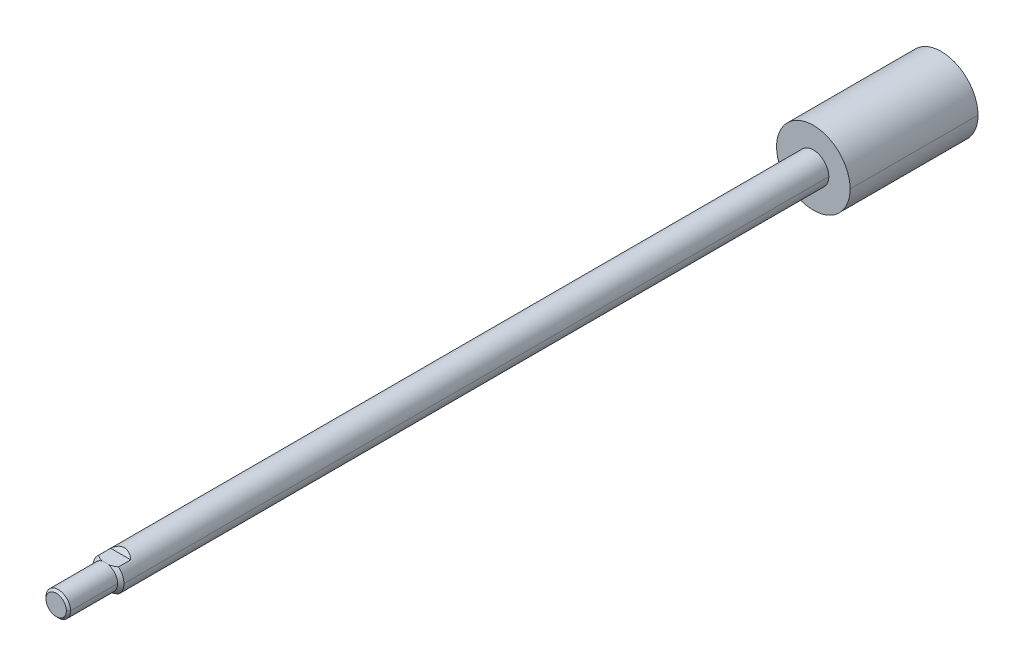
ISO-10303-21;
HEADER;
FILE_DESCRIPTION(('STEP AP214'),'2;1');
FILE_NAME('part.step','',(''),(''),'','','');
FILE_SCHEMA(('AUTOMOTIVE_DESIGN { 1 0 10303 214 1 1 1 1 }'));
ENDSEC;
DATA;
#1=APPLICATION_CONTEXT('core data for automotive mechanical design processes');
#2=APPLICATION_PROTOCOL_DEFINITION('international standard','automotive_design',2000,#1);
#3=PRODUCT_CONTEXT('',#1,'mechanical');
#4=PRODUCT('Part','Part','',(#3));
#5=PRODUCT_RELATED_PRODUCT_CATEGORY('part','',(#4));
#6=PRODUCT_DEFINITION_FORMATION('','',#4);
#7=PRODUCT_DEFINITION_CONTEXT('part definition',#1,'design');
#8=PRODUCT_DEFINITION('design','',#6,#7);
#9=PRODUCT_DEFINITION_SHAPE('','',#8);
#10=(LENGTH_UNIT() NAMED_UNIT(*) SI_UNIT(.MILLI.,.METRE.));
#11=(NAMED_UNIT(*) PLANE_ANGLE_UNIT() SI_UNIT($,.RADIAN.));
#12=(NAMED_UNIT(*) SI_UNIT($,.STERADIAN.) SOLID_ANGLE_UNIT());
#13=UNCERTAINTY_MEASURE_WITH_UNIT(LENGTH_MEASURE(1.E-05),#10,'distance_accuracy_value','');
#14=(GEOMETRIC_REPRESENTATION_CONTEXT(3) GLOBAL_UNCERTAINTY_ASSIGNED_CONTEXT((#13)) GLOBAL_UNIT_ASSIGNED_CONTEXT((#10,
#11,#12)) REPRESENTATION_CONTEXT('',''));
#15=CARTESIAN_POINT('',(0.,0.,0.));
#16=DIRECTION('',(0.,0.,1.));
#17=DIRECTION('',(1.,0.,0.));
#18=AXIS2_PLACEMENT_3D('',#15,#16,#17);
#19=CARTESIAN_POINT('',(8.001,3.048,0.));
#20=DIRECTION('',(0.,1.,0.));
#21=DIRECTION('',(0.,0.,1.));
#22=AXIS2_PLACEMENT_3D('',#19,#20,#21);
#23=PLANE('',#22);
#24=CARTESIAN_POINT('',(0.888999999999997,3.048,0.));
#25=CARTESIAN_POINT('',(1.19636934694901,3.048,-0.0860634171457216));
#26=CARTESIAN_POINT('',(1.48745867684962,3.048,-0.207801742749073));
#27=CARTESIAN_POINT('',(2.05151290563483,3.048,-0.490995024191551));
#28=CARTESIAN_POINT('',(2.32537290457223,3.048,-0.653404332540558));
#29=CARTESIAN_POINT('',(2.59108013191411,3.048,-0.825500000000002));
#30=B_SPLINE_CURVE_WITH_KNOTS('',3,(#24,#25,#26,#27,#28,#29),.UNSPECIFIED.,.F.,.F.,(4,2,4),
(0.011157264649979,0.0121009403352805,0.0130446160205819),.UNSPECIFIED.);
#31=CARTESIAN_POINT('',(0.888999999999997,3.048,0.));
#32=VERTEX_POINT('',#31);
#33=CARTESIAN_POINT('',(2.59108013191411,3.048,-0.825500000000008));
#34=VERTEX_POINT('',#33);
#35=EDGE_CURVE('E11',#32,#34,#30,.T.);
#36=ORIENTED_EDGE('',*,*,#35,.T.);
#37=DIRECTION('',(0.,0.,-1.));
#38=VECTOR('',#37,1.);
#39=CARTESIAN_POINT('',(2.59108013191411,3.048,-216.18575));
#40=LINE('',#39,#38);
#41=CARTESIAN_POINT('',(2.59108013191411,3.048,-3.9878));
#42=VERTEX_POINT('',#41);
#43=EDGE_CURVE('E25',#34,#42,#40,.T.);
#44=ORIENTED_EDGE('',*,*,#43,.T.);
#45=DIRECTION('',(-1.,0.,0.));
#46=VECTOR('',#45,1.);
#47=CARTESIAN_POINT('',(8.001,3.048,-3.9878));
#48=LINE('',#47,#46);
#49=CARTESIAN_POINT('',(-2.59108013191411,3.048,-3.9878));
#50=VERTEX_POINT('',#49);
#51=EDGE_CURVE('E379',#42,#50,#48,.T.);
#52=ORIENTED_EDGE('',*,*,#51,.T.);
#53=DIRECTION('',(0.,0.,-1.));
#54=VECTOR('',#53,1.);
#55=CARTESIAN_POINT('',(-2.59108013191411,3.048,-216.18575));
#56=LINE('',#55,#54);
#57=CARTESIAN_POINT('',(-2.59108013191411,3.048,-0.825500000000008));
#58=VERTEX_POINT('',#57);
#59=EDGE_CURVE('E376',#58,#50,#56,.T.);
#60=ORIENTED_EDGE('',*,*,#59,.F.);
#61=CARTESIAN_POINT('',(-2.59108013191411,3.048,-0.825500000000008));
#62=CARTESIAN_POINT('',(-2.32749145900717,3.048,-0.654776497096182));
#63=CARTESIAN_POINT('',(-2.05688176809806,3.048,-0.493920895952821));
#64=CARTESIAN_POINT('',(-1.48969976149748,3.048,-0.208699648643595));
#65=CARTESIAN_POINT('',(-1.19383279160222,3.048,-0.0853531816486107));
#66=CARTESIAN_POINT('',(-0.889000000000003,3.048,0.));
#67=B_SPLINE_CURVE_WITH_KNOTS('',3,(#61,#62,#63,#64,#65,#66),.UNSPECIFIED.,.F.,.F.,(4,2,4),
(0.00747818459539019,0.00842297104346002,0.00936775749152986),.UNSPECIFIED.);
#68=CARTESIAN_POINT('',(-0.888999999999997,3.048,0.));
#69=VERTEX_POINT('',#68);
#70=EDGE_CURVE('E192',#58,#69,#67,.T.);
#71=ORIENTED_EDGE('',*,*,#70,.T.);
#72=DIRECTION('',(-1.,0.,0.));
#73=VECTOR('',#72,1.);
#74=CARTESIAN_POINT('',(8.001,3.048,0.));
#75=LINE('',#74,#73);
#76=EDGE_CURVE('E360',#32,#69,#75,.T.);
#77=ORIENTED_EDGE('',*,*,#76,.F.);
#78=EDGE_LOOP('',(#36,#44,#52,#60,#71,#77));
#79=FACE_BOUND('',#78,.T.);
#80=ADVANCED_FACE('F17',(#79),#23,.T.);
#81=CARTESIAN_POINT('',(8.001,6.096,0.));
#82=DIRECTION('',(0.,0.,-1.));
#83=DIRECTION('',(-1.,0.,0.));
#84=AXIS2_PLACEMENT_3D('',#81,#82,#83);
#85=PLANE('',#84);
#86=ORIENTED_EDGE('',*,*,#76,.T.);
#87=CARTESIAN_POINT('',(0.,0.,0.));
#88=DIRECTION('',(0.,0.,-1.));
#89=DIRECTION('',(-1.,0.,0.));
#90=AXIS2_PLACEMENT_3D('',#87,#88,#89);
#91=CIRCLE('',#90,3.175);
#92=EDGE_CURVE('E355',#69,#32,#91,.T.);
#93=ORIENTED_EDGE('',*,*,#92,.T.);
#94=EDGE_LOOP('',(#86,#93));
#95=FACE_BOUND('',#94,.T.);
#96=ADVANCED_FACE('F409',(#95),#85,.T.);
#97=CARTESIAN_POINT('',(0.,0.,-216.18575));
#98=DIRECTION('',(0.,0.,1.));
#99=DIRECTION('',(0.,-1.,0.));
#100=AXIS2_PLACEMENT_3D('',#97,#98,#99);
#101=CYLINDRICAL_SURFACE('',#100,3.175);
#102=CARTESIAN_POINT('',(0.,0.,0.));
#103=DIRECTION('',(0.,0.,-1.));
#104=DIRECTION('',(-1.,0.,0.));
#105=AXIS2_PLACEMENT_3D('',#102,#103,#104);
#106=CIRCLE('',#105,3.175);
#107=CARTESIAN_POINT('',(3.175,0.,0.));
#108=VERTEX_POINT('',#107);
#109=EDGE_CURVE('E350',#32,#108,#106,.T.);
#110=ORIENTED_EDGE('',*,*,#109,.F.);
#111=ORIENTED_EDGE('',*,*,#92,.F.);
#112=CARTESIAN_POINT('',(0.,0.,0.));
#113=DIRECTION('',(0.,0.,-1.));
#114=DIRECTION('',(-1.,0.,0.));
#115=AXIS2_PLACEMENT_3D('',#112,#113,#114);
#116=CIRCLE('',#115,3.175);
#117=CARTESIAN_POINT('',(-3.175,0.,0.));
#118=VERTEX_POINT('',#117);
#119=EDGE_CURVE('E346',#118,#69,#116,.T.);
#120=ORIENTED_EDGE('',*,*,#119,.F.);
#121=DIRECTION('',(0.,0.,1.));
#122=VECTOR('',#121,1.);
#123=CARTESIAN_POINT('',(-3.175,0.,0.));
#124=LINE('',#123,#122);
#125=CARTESIAN_POINT('',(-3.175,0.,12.15898));
#126=VERTEX_POINT('',#125);
#127=EDGE_CURVE('E342',#118,#126,#124,.T.);
#128=ORIENTED_EDGE('',*,*,#127,.T.);
#129=CARTESIAN_POINT('',(0.,0.,12.15898));
#130=DIRECTION('',(0.,0.,-1.));
#131=DIRECTION('',(-1.,0.,0.));
#132=AXIS2_PLACEMENT_3D('',#129,#130,#131);
#133=CIRCLE('',#132,3.175);
#134=CARTESIAN_POINT('',(3.175,0.,12.15898));
#135=VERTEX_POINT('',#134);
#136=EDGE_CURVE('E338',#126,#135,#133,.T.);
#137=ORIENTED_EDGE('',*,*,#136,.T.);
#138=DIRECTION('',(0.,0.,1.));
#139=VECTOR('',#138,1.);
#140=CARTESIAN_POINT('',(3.175,0.,0.));
#141=LINE('',#140,#139);
#142=EDGE_CURVE('E333',#108,#135,#141,.T.);
#143=ORIENTED_EDGE('',*,*,#142,.F.);
#144=EDGE_LOOP('',(#110,#111,#120,#128,#137,#143));
#145=FACE_BOUND('',#144,.T.);
#146=ADVANCED_FACE('F413',(#145),#101,.T.);
#147=CARTESIAN_POINT('',(0.,0.,-216.18575));
#148=DIRECTION('',(0.,0.,1.));
#149=DIRECTION('',(0.,1.,0.));
#150=AXIS2_PLACEMENT_3D('',#147,#148,#149);
#151=CYLINDRICAL_SURFACE('',#150,3.175);
#152=CARTESIAN_POINT('',(0.,0.,12.15898));
#153=DIRECTION('',(0.,0.,-1.));
#154=DIRECTION('',(-1.,0.,0.));
#155=AXIS2_PLACEMENT_3D('',#152,#153,#154);
#156=CIRCLE('',#155,3.175);
#157=EDGE_CURVE('E116',#135,#126,#156,.T.);
#158=ORIENTED_EDGE('',*,*,#157,.T.);
#159=ORIENTED_EDGE('',*,*,#127,.F.);
#160=CARTESIAN_POINT('',(0.,0.,0.));
#161=DIRECTION('',(0.,0.,-1.));
#162=DIRECTION('',(-1.,0.,0.));
#163=AXIS2_PLACEMENT_3D('',#160,#161,#162);
#164=CIRCLE('',#163,3.175);
#165=CARTESIAN_POINT('',(-0.889,-3.048,0.));
#166=VERTEX_POINT('',#165);
#167=EDGE_CURVE('E326',#166,#118,#164,.T.);
#168=ORIENTED_EDGE('',*,*,#167,.F.);
#169=CARTESIAN_POINT('',(0.,0.,0.));
#170=DIRECTION('',(0.,0.,-1.));
#171=DIRECTION('',(-1.,0.,0.));
#172=AXIS2_PLACEMENT_3D('',#169,#170,#171);
#173=CIRCLE('',#172,3.175);
#174=CARTESIAN_POINT('',(0.889,-3.048,0.));
#175=VERTEX_POINT('',#174);
#176=EDGE_CURVE('E321',#175,#166,#173,.T.);
#177=ORIENTED_EDGE('',*,*,#176,.F.);
#178=CARTESIAN_POINT('',(0.,0.,0.));
#179=DIRECTION('',(0.,0.,-1.));
#180=DIRECTION('',(-1.,0.,0.));
#181=AXIS2_PLACEMENT_3D('',#178,#179,#180);
#182=CIRCLE('',#181,3.175);
#183=EDGE_CURVE('E319',#108,#175,#182,.T.);
#184=ORIENTED_EDGE('',*,*,#183,.F.);
#185=ORIENTED_EDGE('',*,*,#142,.T.);
#186=EDGE_LOOP('',(#158,#159,#168,#177,#184,#185));
#187=FACE_BOUND('',#186,.T.);
#188=ADVANCED_FACE('F298',(#187),#151,.T.);
#189=CARTESIAN_POINT('',(0.,0.,0.));
#190=DIRECTION('',(0.,0.,-1.));
#191=DIRECTION('',(-1.,0.,0.));
#192=AXIS2_PLACEMENT_3D('',#189,#190,#191);
#193=CONICAL_SURFACE('',#192,3.175,0.7853981634);
#194=CARTESIAN_POINT('',(2.59108013191411,-3.048,-0.825500000000007));
#195=CARTESIAN_POINT('',(2.32749145900718,-3.048,-0.654776497096182));
#196=CARTESIAN_POINT('',(2.05688176809806,-3.048,-0.493920895952823));
#197=CARTESIAN_POINT('',(1.48969976149748,-3.048,-0.208699648643596));
#198=CARTESIAN_POINT('',(1.19383279160222,-3.048,-0.0853531816486109));
#199=CARTESIAN_POINT('',(0.889000000000004,-3.048,0.));
#200=B_SPLINE_CURVE_WITH_KNOTS('',3,(#194,#195,#196,#197,#198,#199),.UNSPECIFIED.,.F.,.F.,(4,2,
4),(0.00747818459539019,0.00842297104346002,0.00936775749152985),.UNSPECIFIED.);
#201=CARTESIAN_POINT('',(2.59108013191411,-3.048,-0.825500000000008));
#202=VERTEX_POINT('',#201);
#203=EDGE_CURVE('E317',#202,#175,#200,.T.);
#204=ORIENTED_EDGE('',*,*,#203,.F.);
#205=CARTESIAN_POINT('',(0.,0.,-0.825500000000008));
#206=DIRECTION('',(0.,0.,-1.));
#207=DIRECTION('',(-1.,0.,0.));
#208=AXIS2_PLACEMENT_3D('',#205,#206,#207);
#209=CIRCLE('',#208,4.0005);
#210=CARTESIAN_POINT('',(4.0005,0.,-0.825500000000005));
#211=VERTEX_POINT('',#210);
#212=EDGE_CURVE('E425',#211,#202,#209,.T.);
#213=ORIENTED_EDGE('',*,*,#212,.F.);
#214=CARTESIAN_POINT('',(0.,0.,-0.825500000000008));
#215=DIRECTION('',(0.,0.,-1.));
#216=DIRECTION('',(-1.,0.,0.));
#217=AXIS2_PLACEMENT_3D('',#214,#215,#216);
#218=CIRCLE('',#217,4.0005);
#219=EDGE_CURVE('E279',#34,#211,#218,.T.);
#220=ORIENTED_EDGE('',*,*,#219,.F.);
#221=ORIENTED_EDGE('',*,*,#35,.F.);
#222=ORIENTED_EDGE('',*,*,#109,.T.);
#223=ORIENTED_EDGE('',*,*,#183,.T.);
#224=EDGE_LOOP('',(#204,#213,#220,#221,#222,#223));
#225=FACE_BOUND('',#224,.T.);
#226=ADVANCED_FACE('F287',(#225),#193,.T.);
#227=CARTESIAN_POINT('',(0.,0.,-216.18575));
#228=DIRECTION('',(0.,0.,1.));
#229=DIRECTION('',(0.,-1.,0.));
#230=AXIS2_PLACEMENT_3D('',#227,#228,#229);
#231=CYLINDRICAL_SURFACE('',#230,4.0005);
#232=CARTESIAN_POINT('',(0.,0.,-183.11495));
#233=DIRECTION('',(0.,0.,-1.));
#234=DIRECTION('',(-1.,0.,0.));
#235=AXIS2_PLACEMENT_3D('',#232,#233,#234);
#236=CIRCLE('',#235,4.0005);
#237=CARTESIAN_POINT('',(-4.0005,0.,-183.11495));
#238=VERTEX_POINT('',#237);
#239=CARTESIAN_POINT('',(4.0005,0.,-183.11495));
#240=VERTEX_POINT('',#239);
#241=EDGE_CURVE('E274',#238,#240,#236,.T.);
#242=ORIENTED_EDGE('',*,*,#241,.F.);
#243=DIRECTION('',(0.,0.,1.));
#244=VECTOR('',#243,1.);
#245=CARTESIAN_POINT('',(-4.0005,0.,-183.11495));
#246=LINE('',#245,#244);
#247=CARTESIAN_POINT('',(-4.0005,0.,-0.825500000000005));
#248=VERTEX_POINT('',#247);
#249=EDGE_CURVE('E270',#238,#248,#246,.T.);
#250=ORIENTED_EDGE('',*,*,#249,.T.);
#251=CARTESIAN_POINT('',(0.,0.,-0.825500000000008));
#252=DIRECTION('',(0.,0.,-1.));
#253=DIRECTION('',(-1.,0.,0.));
#254=AXIS2_PLACEMENT_3D('',#251,#252,#253);
#255=CIRCLE('',#254,4.0005);
#256=EDGE_CURVE('E265',#248,#58,#255,.T.);
#257=ORIENTED_EDGE('',*,*,#256,.T.);
#258=ORIENTED_EDGE('',*,*,#59,.T.);
#259=CARTESIAN_POINT('',(0.,0.,-0.939800000000018));
#260=DIRECTION('',(0.,0.707106781186548,0.707106781186547));
#261=DIRECTION('',(0.,0.707106781186547,-0.707106781186548));
#262=AXIS2_PLACEMENT_3D('',#259,#260,#261);
#263=ELLIPSE('',#262,5.65756135694,4.0005);
#264=EDGE_CURVE('E260',#42,#50,#263,.T.);
#265=ORIENTED_EDGE('',*,*,#264,.F.);
#266=ORIENTED_EDGE('',*,*,#43,.F.);
#267=ORIENTED_EDGE('',*,*,#219,.T.);
#268=DIRECTION('',(0.,0.,1.));
#269=VECTOR('',#268,1.);
#270=CARTESIAN_POINT('',(4.0005,0.,-183.11495));
#271=LINE('',#270,#269);
#272=EDGE_CURVE('E255',#240,#211,#271,.T.);
#273=ORIENTED_EDGE('',*,*,#272,.F.);
#274=EDGE_LOOP('',(#242,#250,#257,#258,#265,#266,#267,#273));
#275=FACE_BOUND('',#274,.T.);
#276=ADVANCED_FACE('F297',(#275),#231,.T.);
#277=CARTESIAN_POINT('',(0.,0.,-216.18575));
#278=DIRECTION('',(0.,0.,1.));
#279=DIRECTION('',(0.,1.,0.));
#280=AXIS2_PLACEMENT_3D('',#277,#278,#279);
#281=CYLINDRICAL_SURFACE('',#280,4.0005);
#282=ORIENTED_EDGE('',*,*,#212,.T.);
#283=DIRECTION('',(0.,0.,-1.));
#284=VECTOR('',#283,1.);
#285=CARTESIAN_POINT('',(2.59108013191411,-3.048,-216.18575));
#286=LINE('',#285,#284);
#287=CARTESIAN_POINT('',(2.59108013191411,-3.048,-3.9878));
#288=VERTEX_POINT('',#287);
#289=EDGE_CURVE('E251',#202,#288,#286,.T.);
#290=ORIENTED_EDGE('',*,*,#289,.T.);
#291=CARTESIAN_POINT('',(0.,0.,-0.939800000000018));
#292=DIRECTION('',(0.,-0.707106781186548,0.707106781186547));
#293=DIRECTION('',(0.,-0.707106781186547,-0.707106781186548));
#294=AXIS2_PLACEMENT_3D('',#291,#292,#293);
#295=ELLIPSE('',#294,5.65756135694,4.0005);
#296=CARTESIAN_POINT('',(-2.59108013191411,-3.048,-3.9878));
#297=VERTEX_POINT('',#296);
#298=EDGE_CURVE('E246',#297,#288,#295,.T.);
#299=ORIENTED_EDGE('',*,*,#298,.F.);
#300=DIRECTION('',(0.,0.,-1.));
#301=VECTOR('',#300,1.);
#302=CARTESIAN_POINT('',(-2.59108013191411,-3.048,-216.18575));
#303=LINE('',#302,#301);
#304=CARTESIAN_POINT('',(-2.59108013191411,-3.048,-0.825500000000008));
#305=VERTEX_POINT('',#304);
#306=EDGE_CURVE('E242',#305,#297,#303,.T.);
#307=ORIENTED_EDGE('',*,*,#306,.F.);
#308=CARTESIAN_POINT('',(0.,0.,-0.825500000000008));
#309=DIRECTION('',(0.,0.,-1.));
#310=DIRECTION('',(-1.,0.,0.));
#311=AXIS2_PLACEMENT_3D('',#308,#309,#310);
#312=CIRCLE('',#311,4.0005);
#313=EDGE_CURVE('E237',#305,#248,#312,.T.);
#314=ORIENTED_EDGE('',*,*,#313,.T.);
#315=ORIENTED_EDGE('',*,*,#249,.F.);
#316=CARTESIAN_POINT('',(0.,0.,-183.11495));
#317=DIRECTION('',(0.,0.,-1.));
#318=DIRECTION('',(-1.,0.,0.));
#319=AXIS2_PLACEMENT_3D('',#316,#317,#318);
#320=CIRCLE('',#319,4.0005);
#321=EDGE_CURVE('E232',#240,#238,#320,.T.);
#322=ORIENTED_EDGE('',*,*,#321,.F.);
#323=ORIENTED_EDGE('',*,*,#272,.T.);
#324=EDGE_LOOP('',(#282,#290,#299,#307,#314,#315,#322,#323));
#325=FACE_BOUND('',#324,.T.);
#326=ADVANCED_FACE('F543',(#325),#281,.T.);
#327=CARTESIAN_POINT('',(0.,4.0005,-183.11495));
#328=DIRECTION('',(0.,0.,-1.));
#329=DIRECTION('',(-1.,0.,0.));
#330=AXIS2_PLACEMENT_3D('',#327,#328,#329);
#331=PLANE('',#330);
#332=CARTESIAN_POINT('',(0.,0.,-183.11495));
#333=DIRECTION('',(0.,0.,-1.));
#334=DIRECTION('',(-1.,0.,0.));
#335=AXIS2_PLACEMENT_3D('',#332,#333,#334);
#336=CIRCLE('',#335,9.5123);
#337=CARTESIAN_POINT('',(-9.5123,0.,-183.11495));
#338=VERTEX_POINT('',#337);
#339=CARTESIAN_POINT('',(9.5123,0.,-183.11495));
#340=VERTEX_POINT('',#339);
#341=EDGE_CURVE('E227',#338,#340,#336,.T.);
#342=ORIENTED_EDGE('',*,*,#341,.F.);
#343=CARTESIAN_POINT('',(0.,0.,-183.11495));
#344=DIRECTION('',(0.,0.,-1.));
#345=DIRECTION('',(-1.,0.,0.));
#346=AXIS2_PLACEMENT_3D('',#343,#344,#345);
#347=CIRCLE('',#346,9.5123);
#348=EDGE_CURVE('E222',#340,#338,#347,.T.);
#349=ORIENTED_EDGE('',*,*,#348,.F.);
#350=EDGE_LOOP('',(#342,#349));
#351=FACE_BOUND('',#350,.T.);
#352=ORIENTED_EDGE('',*,*,#241,.T.);
#353=ORIENTED_EDGE('',*,*,#321,.T.);
#354=EDGE_LOOP('',(#352,#353));
#355=FACE_BOUND('',#354,.T.);
#356=ADVANCED_FACE('F533',(#351,#355),#331,.F.);
#357=CARTESIAN_POINT('',(0.,0.,-216.18575));
#358=DIRECTION('',(0.,0.,1.));
#359=DIRECTION('',(0.,1.,0.));
#360=AXIS2_PLACEMENT_3D('',#357,#358,#359);
#361=CYLINDRICAL_SURFACE('',#360,9.5123);
#362=ORIENTED_EDGE('',*,*,#348,.T.);
#363=DIRECTION('',(0.,0.,1.));
#364=VECTOR('',#363,1.);
#365=CARTESIAN_POINT('',(-9.5123,0.,-216.18575));
#366=LINE('',#365,#364);
#367=CARTESIAN_POINT('',(-9.5123,0.,-216.18575));
#368=VERTEX_POINT('',#367);
#369=EDGE_CURVE('E217',#368,#338,#366,.T.);
#370=ORIENTED_EDGE('',*,*,#369,.F.);
#371=CARTESIAN_POINT('',(0.,0.,-216.18575));
#372=DIRECTION('',(0.,0.,-1.));
#373=DIRECTION('',(-1.,0.,0.));
#374=AXIS2_PLACEMENT_3D('',#371,#372,#373);
#375=CIRCLE('',#374,9.5123);
#376=CARTESIAN_POINT('',(9.5123,0.,-216.18575));
#377=VERTEX_POINT('',#376);
#378=EDGE_CURVE('E212',#377,#368,#375,.T.);
#379=ORIENTED_EDGE('',*,*,#378,.F.);
#380=DIRECTION('',(0.,0.,1.));
#381=VECTOR('',#380,1.);
#382=CARTESIAN_POINT('',(9.5123,0.,-216.18575));
#383=LINE('',#382,#381);
#384=EDGE_CURVE('E207',#377,#340,#383,.T.);
#385=ORIENTED_EDGE('',*,*,#384,.T.);
#386=EDGE_LOOP('',(#362,#370,#379,#385));
#387=FACE_BOUND('',#386,.T.);
#388=ADVANCED_FACE('F523',(#387),#361,.T.);
#389=CARTESIAN_POINT('',(0.,0.,-216.18575));
#390=DIRECTION('',(0.,0.,1.));
#391=DIRECTION('',(0.,-1.,0.));
#392=AXIS2_PLACEMENT_3D('',#389,#390,#391);
#393=CYLINDRICAL_SURFACE('',#392,9.5123);
#394=CARTESIAN_POINT('',(0.,0.,-216.18575));
#395=DIRECTION('',(0.,0.,-1.));
#396=DIRECTION('',(-1.,0.,0.));
#397=AXIS2_PLACEMENT_3D('',#394,#395,#396);
#398=CIRCLE('',#397,9.5123);
#399=EDGE_CURVE('E204',#368,#377,#398,.T.);
#400=ORIENTED_EDGE('',*,*,#399,.F.);
#401=ORIENTED_EDGE('',*,*,#369,.T.);
#402=ORIENTED_EDGE('',*,*,#341,.T.);
#403=ORIENTED_EDGE('',*,*,#384,.F.);
#404=EDGE_LOOP('',(#400,#401,#402,#403));
#405=FACE_BOUND('',#404,.T.);
#406=ADVANCED_FACE('F514',(#405),#393,.T.);
#407=CARTESIAN_POINT('',(0.,9.5123,-216.18575));
#408=DIRECTION('',(0.,0.,1.));
#409=DIRECTION('',(1.,0.,0.));
#410=AXIS2_PLACEMENT_3D('',#407,#408,#409);
#411=PLANE('',#410);
#412=ORIENTED_EDGE('',*,*,#399,.T.);
#413=ORIENTED_EDGE('',*,*,#378,.T.);
#414=EDGE_LOOP('',(#412,#413));
#415=FACE_BOUND('',#414,.T.);
#416=ADVANCED_FACE('F506',(#415),#411,.F.);
#417=CARTESIAN_POINT('',(0.,0.,0.));
#418=DIRECTION('',(0.,0.,-1.));
#419=DIRECTION('',(1.,0.,0.));
#420=AXIS2_PLACEMENT_3D('',#417,#418,#419);
#421=CONICAL_SURFACE('',#420,3.175,0.7853981634);
#422=CARTESIAN_POINT('',(-0.889000000000003,-3.048,0.));
#423=CARTESIAN_POINT('',(-1.19636934694901,-3.048,-0.0860634171457224));
#424=CARTESIAN_POINT('',(-1.48745867684963,-3.048,-0.207801742749073));
#425=CARTESIAN_POINT('',(-2.05151290563483,-3.048,-0.490995024191553));
#426=CARTESIAN_POINT('',(-2.32537290457224,-3.048,-0.653404332540557));
#427=CARTESIAN_POINT('',(-2.59108013191411,-3.048,-0.825500000000002));
#428=B_SPLINE_CURVE_WITH_KNOTS('',3,(#422,#423,#424,#425,#426,#427),.UNSPECIFIED.,.F.,.F.,(4,2,
4),(0.011157264649979,0.0121009403352805,0.0130446160205819),.UNSPECIFIED.);
#429=EDGE_CURVE('E178',#166,#305,#428,.T.);
#430=ORIENTED_EDGE('',*,*,#429,.F.);
#431=ORIENTED_EDGE('',*,*,#167,.T.);
#432=ORIENTED_EDGE('',*,*,#119,.T.);
#433=ORIENTED_EDGE('',*,*,#70,.F.);
#434=ORIENTED_EDGE('',*,*,#256,.F.);
#435=ORIENTED_EDGE('',*,*,#313,.F.);
#436=EDGE_LOOP('',(#430,#431,#432,#433,#434,#435));
#437=FACE_BOUND('',#436,.T.);
#438=ADVANCED_FACE('F157',(#437),#421,.T.);
#439=CARTESIAN_POINT('',(8.001,-3.048,-3.9878));
#440=DIRECTION('',(0.,-1.,0.));
#441=DIRECTION('',(0.,0.,-1.));
#442=AXIS2_PLACEMENT_3D('',#439,#440,#441);
#443=PLANE('',#442);
#444=ORIENTED_EDGE('',*,*,#429,.T.);
#445=ORIENTED_EDGE('',*,*,#306,.T.);
#446=DIRECTION('',(-1.,0.,0.));
#447=VECTOR('',#446,1.);
#448=CARTESIAN_POINT('',(8.001,-3.048,-3.9878));
#449=LINE('',#448,#447);
#450=EDGE_CURVE('E130',#288,#297,#449,.T.);
#451=ORIENTED_EDGE('',*,*,#450,.F.);
#452=ORIENTED_EDGE('',*,*,#289,.F.);
#453=ORIENTED_EDGE('',*,*,#203,.T.);
#454=DIRECTION('',(-1.,0.,0.));
#455=VECTOR('',#454,1.);
#456=CARTESIAN_POINT('',(8.001,-3.048,0.));
#457=LINE('',#456,#455);
#458=EDGE_CURVE('E127',#175,#166,#457,.T.);
#459=ORIENTED_EDGE('',*,*,#458,.T.);
#460=EDGE_LOOP('',(#444,#445,#451,#452,#453,#459));
#461=FACE_BOUND('',#460,.T.);
#462=ADVANCED_FACE('F146',(#461),#443,.T.);
#463=CARTESIAN_POINT('',(8.001,-3.048,0.));
#464=DIRECTION('',(0.,0.,-1.));
#465=DIRECTION('',(-1.,0.,0.));
#466=AXIS2_PLACEMENT_3D('',#463,#464,#465);
#467=PLANE('',#466);
#468=ORIENTED_EDGE('',*,*,#176,.T.);
#469=ORIENTED_EDGE('',*,*,#458,.F.);
#470=EDGE_LOOP('',(#468,#469));
#471=FACE_BOUND('',#470,.T.);
#472=ADVANCED_FACE('F156',(#471),#467,.T.);
#473=CARTESIAN_POINT('',(8.001,-6.096,-7.0358));
#474=DIRECTION('',(0.,-0.707106781186548,0.707106781186548));
#475=DIRECTION('',(0.,-0.707106781186548,-0.707106781186548));
#476=AXIS2_PLACEMENT_3D('',#473,#474,#475);
#477=PLANE('',#476);
#478=ORIENTED_EDGE('',*,*,#298,.T.);
#479=ORIENTED_EDGE('',*,*,#450,.T.);
#480=EDGE_LOOP('',(#478,#479));
#481=FACE_BOUND('',#480,.T.);
#482=ADVANCED_FACE('F399',(#481),#477,.T.);
#483=CARTESIAN_POINT('',(8.001,3.048,-3.9878));
#484=DIRECTION('',(0.,0.707106781186548,0.707106781186548));
#485=DIRECTION('',(0.,-0.707106781186548,0.707106781186548));
#486=AXIS2_PLACEMENT_3D('',#483,#484,#485);
#487=PLANE('',#486);
#488=ORIENTED_EDGE('',*,*,#264,.T.);
#489=ORIENTED_EDGE('',*,*,#51,.F.);
#490=EDGE_LOOP('',(#488,#489));
#491=FACE_BOUND('',#490,.T.);
#492=ADVANCED_FACE('F397',(#491),#487,.T.);
#493=CARTESIAN_POINT('',(0.,0.,12.7));
#494=DIRECTION('',(0.,0.,-1.));
#495=DIRECTION('',(0.,1.,0.));
#496=AXIS2_PLACEMENT_3D('',#493,#494,#495);
#497=CONICAL_SURFACE('',#496,2.63398,0.7853981634);
#498=CARTESIAN_POINT('',(0.,0.,12.7));
#499=DIRECTION('',(0.,0.,-1.));
#500=DIRECTION('',(-1.,0.,0.));
#501=AXIS2_PLACEMENT_3D('',#498,#499,#500);
#502=CIRCLE('',#501,2.63398);
#503=CARTESIAN_POINT('',(2.63398,0.,12.7));
#504=VERTEX_POINT('',#503);
#505=CARTESIAN_POINT('',(-2.63398,0.,12.7));
#506=VERTEX_POINT('',#505);
#507=EDGE_CURVE('E113',#504,#506,#502,.T.);
#508=ORIENTED_EDGE('',*,*,#507,.T.);
#509=DIRECTION('',(-0.707106781188351,0.,-0.707106781184744));
#510=VECTOR('',#509,1.);
#511=CARTESIAN_POINT('',(-2.63398,0.,12.7));
#512=LINE('',#511,#510);
#513=EDGE_CURVE('E119',#506,#126,#512,.T.);
#514=ORIENTED_EDGE('',*,*,#513,.T.);
#515=ORIENTED_EDGE('',*,*,#157,.F.);
#516=DIRECTION('',(0.707106781188351,0.,-0.707106781184744));
#517=VECTOR('',#516,1.);
#518=CARTESIAN_POINT('',(2.63398,0.,12.7));
#519=LINE('',#518,#517);
#520=EDGE_CURVE('E108',#504,#135,#519,.T.);
#521=ORIENTED_EDGE('',*,*,#520,.F.);
#522=EDGE_LOOP('',(#508,#514,#515,#521));
#523=FACE_BOUND('',#522,.T.);
#524=ADVANCED_FACE('F110',(#523),#497,.T.);
#525=CARTESIAN_POINT('',(0.,0.,12.7));
#526=DIRECTION('',(0.,0.,-1.));
#527=DIRECTION('',(0.,-1.,0.));
#528=AXIS2_PLACEMENT_3D('',#525,#526,#527);
#529=CONICAL_SURFACE('',#528,2.63398,0.7853981634);
#530=ORIENTED_EDGE('',*,*,#136,.F.);
#531=ORIENTED_EDGE('',*,*,#513,.F.);
#532=CARTESIAN_POINT('',(0.,0.,12.7));
#533=DIRECTION('',(0.,0.,-1.));
#534=DIRECTION('',(-1.,0.,0.));
#535=AXIS2_PLACEMENT_3D('',#532,#533,#534);
#536=CIRCLE('',#535,2.63398);
#537=EDGE_CURVE('E120',#506,#504,#536,.T.);
#538=ORIENTED_EDGE('',*,*,#537,.T.);
#539=ORIENTED_EDGE('',*,*,#520,.T.);
#540=EDGE_LOOP('',(#530,#531,#538,#539));
#541=FACE_BOUND('',#540,.T.);
#542=ADVANCED_FACE('F123',(#541),#529,.T.);
#543=CARTESIAN_POINT('',(0.,0.,12.7));
#544=DIRECTION('',(0.,0.,-1.));
#545=DIRECTION('',(-1.,0.,0.));
#546=AXIS2_PLACEMENT_3D('',#543,#544,#545);
#547=PLANE('',#546);
#548=ORIENTED_EDGE('',*,*,#537,.F.);
#549=ORIENTED_EDGE('',*,*,#507,.F.);
#550=EDGE_LOOP('',(#548,#549));
#551=FACE_BOUND('',#550,.T.);
#552=ADVANCED_FACE('F126',(#551),#547,.F.);
#553=CLOSED_SHELL('',(#80,#96,#146,#188,#226,#276,#326,#356,#388,#406,#416,#438,#462,#472,#482,
#492,#524,#542,#552));
#554=MANIFOLD_SOLID_BREP('B1',#553);
#555=ADVANCED_BREP_SHAPE_REPRESENTATION('',(#18,#554),#14);
#556=SHAPE_DEFINITION_REPRESENTATION(#9,#555);
ENDSEC;
END-ISO-10303-21;
